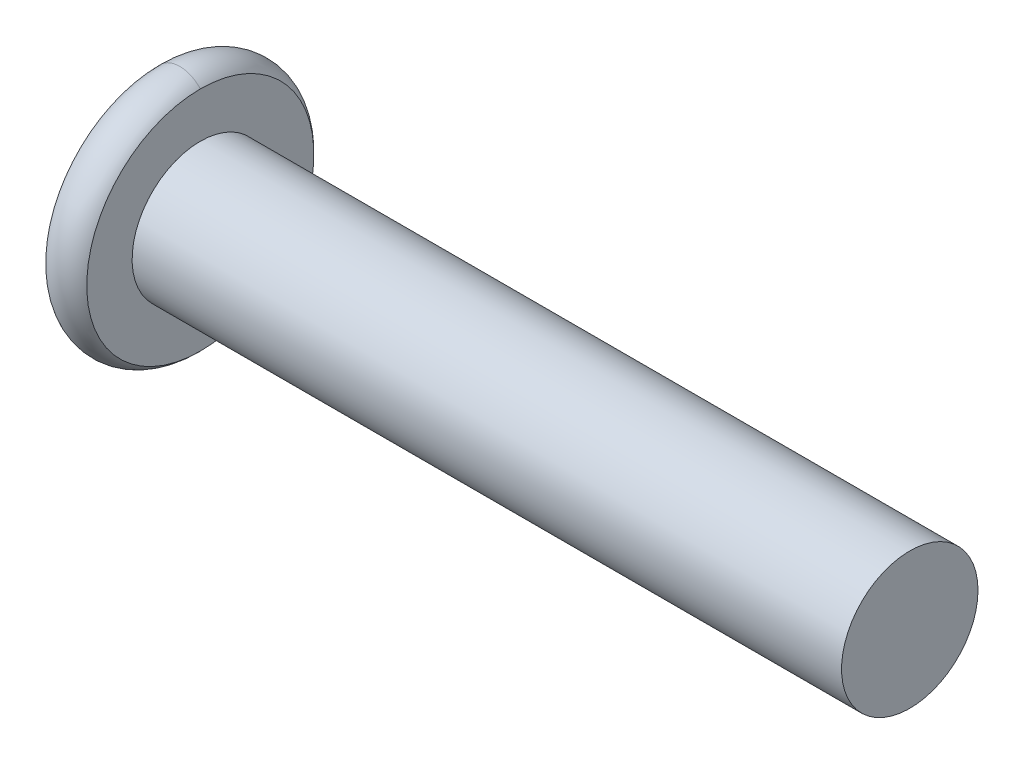
ISO-10303-21;
HEADER;
FILE_DESCRIPTION(('STEP AP214'),'2;1');
FILE_NAME('part.step','',(''),(''),'','','');
FILE_SCHEMA(('AUTOMOTIVE_DESIGN { 1 0 10303 214 1 1 1 1 }'));
ENDSEC;
DATA;
#1=APPLICATION_CONTEXT('core data for automotive mechanical design processes');
#2=APPLICATION_PROTOCOL_DEFINITION('international standard','automotive_design',2000,#1);
#3=PRODUCT_CONTEXT('',#1,'mechanical');
#4=PRODUCT('Part','Part','',(#3));
#5=PRODUCT_RELATED_PRODUCT_CATEGORY('part','',(#4));
#6=PRODUCT_DEFINITION_FORMATION('','',#4);
#7=PRODUCT_DEFINITION_CONTEXT('part definition',#1,'design');
#8=PRODUCT_DEFINITION('design','',#6,#7);
#9=PRODUCT_DEFINITION_SHAPE('','',#8);
#10=(LENGTH_UNIT() NAMED_UNIT(*) SI_UNIT(.MILLI.,.METRE.));
#11=(NAMED_UNIT(*) PLANE_ANGLE_UNIT() SI_UNIT($,.RADIAN.));
#12=(NAMED_UNIT(*) SI_UNIT($,.STERADIAN.) SOLID_ANGLE_UNIT());
#13=UNCERTAINTY_MEASURE_WITH_UNIT(LENGTH_MEASURE(1.E-05),#10,'distance_accuracy_value','');
#14=(GEOMETRIC_REPRESENTATION_CONTEXT(3) GLOBAL_UNCERTAINTY_ASSIGNED_CONTEXT((#13)) GLOBAL_UNIT_ASSIGNED_CONTEXT((#10,
#11,#12)) REPRESENTATION_CONTEXT('',''));
#15=CARTESIAN_POINT('',(0.,0.,0.));
#16=DIRECTION('',(0.,0.,1.));
#17=DIRECTION('',(1.,0.,0.));
#18=AXIS2_PLACEMENT_3D('',#15,#16,#17);
#19=CARTESIAN_POINT('',(-7.2,0.866025403784466,1.5));
#20=DIRECTION('',(0.,0.866025403784439,0.5));
#21=DIRECTION('',(1.,0.,0.));
#22=AXIS2_PLACEMENT_3D('',#19,#20,#21);
#23=PLANE('',#22);
#24=DIRECTION('',(0.,0.5,-0.866025403784439));
#25=VECTOR('',#24,1.);
#26=CARTESIAN_POINT('',(-8.,0.866025403784468,1.5));
#27=LINE('',#26,#25);
#28=CARTESIAN_POINT('',(-8.,0.866025403784469,1.5));
#29=VERTEX_POINT('',#28);
#30=CARTESIAN_POINT('',(-8.,1.73205080756891,0.));
#31=VERTEX_POINT('',#30);
#32=EDGE_CURVE('E61',#29,#31,#27,.T.);
#33=ORIENTED_EDGE('',*,*,#32,.F.);
#34=DIRECTION('',(-1.,0.,0.));
#35=VECTOR('',#34,1.);
#36=CARTESIAN_POINT('',(-7.2,0.866025403784466,1.5));
#37=LINE('',#36,#35);
#38=CARTESIAN_POINT('',(-9.45,0.866025403784475,1.5));
#39=VERTEX_POINT('',#38);
#40=EDGE_CURVE('E11',#29,#39,#37,.T.);
#41=ORIENTED_EDGE('',*,*,#40,.T.);
#42=CARTESIAN_POINT('',(-9.45,0.866025403784475,1.5));
#43=CARTESIAN_POINT('',(-9.21896355129934,1.09706185248514,1.09983313245017));
#44=CARTESIAN_POINT('',(-9.21795258499127,1.29744298091271,0.752762837135629));
#45=CARTESIAN_POINT('',(-9.21693575385997,1.49898656142989,0.403679115740523));
#46=CARTESIAN_POINT('',(-9.45000000000001,1.73205080756891,0.));
#47=B_SPLINE_CURVE_WITH_KNOTS('',2,(#42,#43,#44,#45,#46),.UNSPECIFIED.,.F.,.F.,(3,2,3),(0.,0.5,
1.),.UNSPECIFIED.);
#48=CARTESIAN_POINT('',(-9.45,1.73205080756891,0.));
#49=VERTEX_POINT('',#48);
#50=EDGE_CURVE('E193',#39,#49,#47,.T.);
#51=ORIENTED_EDGE('',*,*,#50,.T.);
#52=DIRECTION('',(-1.,0.,0.));
#53=VECTOR('',#52,1.);
#54=CARTESIAN_POINT('',(-7.2,1.7320508075689,0.));
#55=LINE('',#54,#53);
#56=EDGE_CURVE('E141',#31,#49,#55,.T.);
#57=ORIENTED_EDGE('',*,*,#56,.F.);
#58=EDGE_LOOP('',(#33,#41,#51,#57));
#59=FACE_BOUND('',#58,.T.);
#60=ADVANCED_FACE('F46',(#59),#23,.F.);
#61=CARTESIAN_POINT('',(-7.2,-0.866025403784412,1.5));
#62=DIRECTION('',(0.,0.,1.));
#63=DIRECTION('',(1.,0.,0.));
#64=AXIS2_PLACEMENT_3D('',#61,#62,#63);
#65=PLANE('',#64);
#66=DIRECTION('',(0.,1.,0.));
#67=VECTOR('',#66,1.);
#68=CARTESIAN_POINT('',(-8.,-0.866025403784412,1.5));
#69=LINE('',#68,#67);
#70=CARTESIAN_POINT('',(-8.,-0.866025403784409,1.5));
#71=VERTEX_POINT('',#70);
#72=EDGE_CURVE('E68',#71,#29,#69,.T.);
#73=ORIENTED_EDGE('',*,*,#72,.F.);
#74=DIRECTION('',(-1.,0.,0.));
#75=VECTOR('',#74,1.);
#76=CARTESIAN_POINT('',(-7.2,-0.866025403784412,1.5));
#77=LINE('',#76,#75);
#78=CARTESIAN_POINT('',(-9.45,-0.866025403784403,1.5));
#79=VERTEX_POINT('',#78);
#80=EDGE_CURVE('E55',#71,#79,#77,.T.);
#81=ORIENTED_EDGE('',*,*,#80,.T.);
#82=CARTESIAN_POINT('',(-9.45,-0.866025403784404,1.5));
#83=CARTESIAN_POINT('',(-9.33975644233454,-0.645538288453465,1.5));
#84=CARTESIAN_POINT('',(-9.28279119856986,-0.445791996536774,1.5));
#85=CARTESIAN_POINT('',(-9.21800737472854,-0.218630174111427,1.5));
#86=CARTESIAN_POINT('',(-9.2179492007936,0.000158389989295951,1.5));
#87=CARTESIAN_POINT('',(-9.21789132396221,0.21782956601381,1.5));
#88=CARTESIAN_POINT('',(-9.28285189688767,0.446005016133118,1.5));
#89=CARTESIAN_POINT('',(-9.33952821229706,0.645081828378593,1.5));
#90=CARTESIAN_POINT('',(-9.45,0.866025403784473,1.5));
#91=B_SPLINE_CURVE_WITH_KNOTS('',2,(#82,#83,#84,#85,#86,#87,#88,#89,#90),.UNSPECIFIED.,.F.,.F.,
(3,2,2,2,3),(0.,0.25,0.5,0.75,1.),.UNSPECIFIED.);
#92=EDGE_CURVE('E278',#79,#39,#91,.T.);
#93=ORIENTED_EDGE('',*,*,#92,.T.);
#94=ORIENTED_EDGE('',*,*,#40,.F.);
#95=EDGE_LOOP('',(#73,#81,#93,#94));
#96=FACE_BOUND('',#95,.T.);
#97=ADVANCED_FACE('F222',(#96),#65,.F.);
#98=CARTESIAN_POINT('',(-7.2,-1.73205080756885,0.));
#99=DIRECTION('',(0.,-0.866025403784439,0.5));
#100=DIRECTION('',(-1.,0.,0.));
#101=AXIS2_PLACEMENT_3D('',#98,#99,#100);
#102=PLANE('',#101);
#103=DIRECTION('',(0.,0.5,0.866025403784439));
#104=VECTOR('',#103,1.);
#105=CARTESIAN_POINT('',(-8.,-1.73205080756885,0.));
#106=LINE('',#105,#104);
#107=CARTESIAN_POINT('',(-8.,-1.73205080756885,0.));
#108=VERTEX_POINT('',#107);
#109=EDGE_CURVE('E158',#108,#71,#106,.T.);
#110=ORIENTED_EDGE('',*,*,#109,.F.);
#111=DIRECTION('',(-1.,0.,0.));
#112=VECTOR('',#111,1.);
#113=CARTESIAN_POINT('',(-7.2,-1.73205080756885,0.));
#114=LINE('',#113,#112);
#115=CARTESIAN_POINT('',(-9.45,-1.73205080756884,0.));
#116=VERTEX_POINT('',#115);
#117=EDGE_CURVE('E557',#108,#116,#114,.T.);
#118=ORIENTED_EDGE('',*,*,#117,.T.);
#119=CARTESIAN_POINT('',(-9.45,-1.73205080756884,0.));
#120=CARTESIAN_POINT('',(-9.21896355129749,-1.50101435886632,0.400166867553041));
#121=CARTESIAN_POINT('',(-9.21795258499127,-1.30063323044061,0.747237162864371));
#122=CARTESIAN_POINT('',(-9.21693575386182,-1.09908964992158,1.09632088426268));
#123=CARTESIAN_POINT('',(-9.45,-0.866025403784404,1.5));
#124=B_SPLINE_CURVE_WITH_KNOTS('',2,(#119,#120,#121,#122,#123),.UNSPECIFIED.,.F.,.F.,(3,2,3),
(0.,0.5,1.),.UNSPECIFIED.);
#125=EDGE_CURVE('E204',#116,#79,#124,.T.);
#126=ORIENTED_EDGE('',*,*,#125,.T.);
#127=ORIENTED_EDGE('',*,*,#80,.F.);
#128=EDGE_LOOP('',(#110,#118,#126,#127));
#129=FACE_BOUND('',#128,.T.);
#130=ADVANCED_FACE('F211',(#129),#102,.F.);
#131=CARTESIAN_POINT('',(-7.2,-0.866025403784411,-1.5));
#132=DIRECTION('',(0.,-0.866025403784439,-0.5));
#133=DIRECTION('',(0.,0.5,-0.866025403784439));
#134=AXIS2_PLACEMENT_3D('',#131,#132,#133);
#135=PLANE('',#134);
#136=DIRECTION('',(0.,-0.5,0.866025403784439));
#137=VECTOR('',#136,1.);
#138=CARTESIAN_POINT('',(-8.,-0.866025403784409,-1.5));
#139=LINE('',#138,#137);
#140=CARTESIAN_POINT('',(-8.,-0.866025403784408,-1.5));
#141=VERTEX_POINT('',#140);
#142=EDGE_CURVE('E149',#141,#108,#139,.T.);
#143=ORIENTED_EDGE('',*,*,#142,.F.);
#144=DIRECTION('',(-1.,0.,0.));
#145=VECTOR('',#144,1.);
#146=CARTESIAN_POINT('',(-7.2,-0.866025403784411,-1.5));
#147=LINE('',#146,#145);
#148=CARTESIAN_POINT('',(-9.45,-0.866025403784402,-1.5));
#149=VERTEX_POINT('',#148);
#150=EDGE_CURVE('E140',#141,#149,#147,.T.);
#151=ORIENTED_EDGE('',*,*,#150,.T.);
#152=CARTESIAN_POINT('',(-9.45,-0.866025403784402,-1.5));
#153=CARTESIAN_POINT('',(-9.21896355129935,-1.09706185248507,-1.09983313245016));
#154=CARTESIAN_POINT('',(-9.21795258499128,-1.29744298091264,-0.752762837135629));
#155=CARTESIAN_POINT('',(-9.21693575385997,-1.49898656142982,-0.403679115740524));
#156=CARTESIAN_POINT('',(-9.45,-1.73205080756884,0.));
#157=B_SPLINE_CURVE_WITH_KNOTS('',2,(#152,#153,#154,#155,#156),.UNSPECIFIED.,.F.,.F.,(3,2,3),
(0.,0.5,1.),.UNSPECIFIED.);
#158=EDGE_CURVE('E349',#149,#116,#157,.T.);
#159=ORIENTED_EDGE('',*,*,#158,.T.);
#160=ORIENTED_EDGE('',*,*,#117,.F.);
#161=EDGE_LOOP('',(#143,#151,#159,#160));
#162=FACE_BOUND('',#161,.T.);
#163=ADVANCED_FACE('F221',(#162),#135,.F.);
#164=CARTESIAN_POINT('',(-7.2,0.866025403784466,-1.5));
#165=DIRECTION('',(0.,0.,-1.));
#166=DIRECTION('',(0.,-1.,0.));
#167=AXIS2_PLACEMENT_3D('',#164,#165,#166);
#168=PLANE('',#167);
#169=DIRECTION('',(0.,-1.,0.));
#170=VECTOR('',#169,1.);
#171=CARTESIAN_POINT('',(-8.,0.866025403784466,-1.5));
#172=LINE('',#171,#170);
#173=CARTESIAN_POINT('',(-8.,0.866025403784469,-1.5));
#174=VERTEX_POINT('',#173);
#175=EDGE_CURVE('E145',#174,#141,#172,.T.);
#176=ORIENTED_EDGE('',*,*,#175,.F.);
#177=DIRECTION('',(-1.,0.,0.));
#178=VECTOR('',#177,1.);
#179=CARTESIAN_POINT('',(-7.2,0.866025403784466,-1.5));
#180=LINE('',#179,#178);
#181=CARTESIAN_POINT('',(-9.45,0.866025403784475,-1.5));
#182=VERTEX_POINT('',#181);
#183=EDGE_CURVE('E129',#174,#182,#180,.T.);
#184=ORIENTED_EDGE('',*,*,#183,.T.);
#185=CARTESIAN_POINT('',(-9.45,0.866025403784475,-1.5));
#186=CARTESIAN_POINT('',(-9.33981414699266,0.645653697769757,-1.5));
#187=CARTESIAN_POINT('',(-9.28285189688768,0.446005016133116,-1.5));
#188=CARTESIAN_POINT('',(-9.2180530845752,0.21888973494314,-1.5));
#189=CARTESIAN_POINT('',(-9.2179492007936,0.000158389989295951,-1.5));
#190=CARTESIAN_POINT('',(-9.21784579402437,-0.217568586838098,-1.5));
#191=CARTESIAN_POINT('',(-9.28279119856986,-0.445791996536774,-1.5));
#192=CARTESIAN_POINT('',(-9.33946967648958,-0.644964756763549,-1.5));
#193=CARTESIAN_POINT('',(-9.45,-0.866025403784404,-1.5));
#194=B_SPLINE_CURVE_WITH_KNOTS('',2,(#185,#186,#187,#188,#189,#190,#191,#192,#193),
.UNSPECIFIED.,.F.,.F.,(3,2,2,2,3),(0.,0.25,0.5,0.75,1.),.UNSPECIFIED.);
#195=EDGE_CURVE('E199',#182,#149,#194,.T.);
#196=ORIENTED_EDGE('',*,*,#195,.T.);
#197=ORIENTED_EDGE('',*,*,#150,.F.);
#198=EDGE_LOOP('',(#176,#184,#196,#197));
#199=FACE_BOUND('',#198,.T.);
#200=ADVANCED_FACE('F146',(#199),#168,.F.);
#201=CARTESIAN_POINT('',(-7.2,1.7320508075689,0.));
#202=DIRECTION('',(0.,0.866025403784439,-0.5));
#203=DIRECTION('',(-1.,0.,0.));
#204=AXIS2_PLACEMENT_3D('',#201,#202,#203);
#205=PLANE('',#204);
#206=DIRECTION('',(0.,-0.5,-0.866025403784439));
#207=VECTOR('',#206,1.);
#208=CARTESIAN_POINT('',(-8.,1.73205080756891,0.));
#209=LINE('',#208,#207);
#210=EDGE_CURVE('E133',#31,#174,#209,.T.);
#211=ORIENTED_EDGE('',*,*,#210,.F.);
#212=ORIENTED_EDGE('',*,*,#56,.T.);
#213=CARTESIAN_POINT('',(-9.45,1.73205080756891,0.));
#214=CARTESIAN_POINT('',(-9.21896355129874,1.50101435886761,-0.400166867550929));
#215=CARTESIAN_POINT('',(-9.21795258499128,1.30063323044068,-0.747237162864371));
#216=CARTESIAN_POINT('',(-9.21693575386058,1.09908964992289,-1.09632088426053));
#217=CARTESIAN_POINT('',(-9.45000000000001,0.866025403784475,-1.5));
#218=B_SPLINE_CURVE_WITH_KNOTS('',2,(#213,#214,#215,#216,#217),.UNSPECIFIED.,.F.,.F.,(3,2,3),
(0.,0.5,1.),.UNSPECIFIED.);
#219=EDGE_CURVE('E135',#49,#182,#218,.T.);
#220=ORIENTED_EDGE('',*,*,#219,.T.);
#221=ORIENTED_EDGE('',*,*,#183,.F.);
#222=EDGE_LOOP('',(#211,#212,#220,#221));
#223=FACE_BOUND('',#222,.T.);
#224=ADVANCED_FACE('F131',(#223),#205,.F.);
#225=CARTESIAN_POINT('',(-9.5,0.,0.));
#226=DIRECTION('',(-1.,0.,0.));
#227=DIRECTION('',(0.,-1.,0.));
#228=AXIS2_PLACEMENT_3D('',#225,#226,#227);
#229=CONICAL_SURFACE('',#228,1.78205080756887,0.78539816339745);
#230=DIRECTION('',(-0.707106781186544,0.707106781186552,0.));
#231=VECTOR('',#230,1.);
#232=CARTESIAN_POINT('',(-9.5,1.7820508075689,0.));
#233=LINE('',#232,#231);
#234=CARTESIAN_POINT('',(-9.5,1.7820508075689,0.));
#235=VERTEX_POINT('',#234);
#236=EDGE_CURVE('E174',#49,#235,#233,.T.);
#237=ORIENTED_EDGE('',*,*,#236,.F.);
#238=ORIENTED_EDGE('',*,*,#50,.F.);
#239=ORIENTED_EDGE('',*,*,#92,.F.);
#240=ORIENTED_EDGE('',*,*,#125,.F.);
#241=DIRECTION('',(-0.707106781186549,-0.707106781186546,0.));
#242=VECTOR('',#241,1.);
#243=CARTESIAN_POINT('',(-9.5,-1.78205080756883,0.));
#244=LINE('',#243,#242);
#245=CARTESIAN_POINT('',(-9.5,-1.78205080756883,0.));
#246=VERTEX_POINT('',#245);
#247=EDGE_CURVE('E173',#116,#246,#244,.T.);
#248=ORIENTED_EDGE('',*,*,#247,.T.);
#249=CARTESIAN_POINT('',(-9.5,0.,0.));
#250=DIRECTION('',(-1.,0.,0.));
#251=DIRECTION('',(0.,-1.,0.));
#252=AXIS2_PLACEMENT_3D('',#249,#250,#251);
#253=CIRCLE('',#252,1.78205080756887);
#254=EDGE_CURVE('E187',#246,#235,#253,.T.);
#255=ORIENTED_EDGE('',*,*,#254,.T.);
#256=EDGE_LOOP('',(#237,#238,#239,#240,#248,#255));
#257=FACE_BOUND('',#256,.T.);
#258=ADVANCED_FACE('F250',(#257),#229,.F.);
#259=CARTESIAN_POINT('',(-8.,4.16143782776614,0.));
#260=DIRECTION('',(1.,0.,0.));
#261=DIRECTION('',(0.,1.,0.));
#262=AXIS2_PLACEMENT_3D('',#259,#260,#261);
#263=PLANE('',#262);
#264=CARTESIAN_POINT('',(-8.,0.,0.));
#265=DIRECTION('',(-1.,0.,0.));
#266=DIRECTION('',(0.,1.,0.));
#267=AXIS2_PLACEMENT_3D('',#264,#265,#266);
#268=CIRCLE('',#267,2.5);
#269=CARTESIAN_POINT('',(-8.,2.49999999999999,0.));
#270=VERTEX_POINT('',#269);
#271=EDGE_CURVE('E179',#270,#270,#268,.T.);
#272=ORIENTED_EDGE('',*,*,#271,.T.);
#273=EDGE_LOOP('',(#272));
#274=FACE_BOUND('',#273,.T.);
#275=CARTESIAN_POINT('',(-8.,0.,0.));
#276=DIRECTION('',(1.,0.,0.));
#277=DIRECTION('',(0.,1.,0.));
#278=AXIS2_PLACEMENT_3D('',#275,#276,#277);
#279=CIRCLE('',#278,4.16143782776614);
#280=CARTESIAN_POINT('',(-8.,4.16143782776614,0.));
#281=VERTEX_POINT('',#280);
#282=CARTESIAN_POINT('',(-8.,-4.16143782776614,0.));
#283=VERTEX_POINT('',#282);
#284=EDGE_CURVE('E167',#281,#283,#279,.T.);
#285=ORIENTED_EDGE('',*,*,#284,.T.);
#286=CARTESIAN_POINT('',(-8.,0.,0.));
#287=DIRECTION('',(1.,0.,0.));
#288=DIRECTION('',(0.,1.,0.));
#289=AXIS2_PLACEMENT_3D('',#286,#287,#288);
#290=CIRCLE('',#289,4.16143782776614);
#291=EDGE_CURVE('E190',#283,#281,#290,.T.);
#292=ORIENTED_EDGE('',*,*,#291,.T.);
#293=EDGE_LOOP('',(#285,#292));
#294=FACE_BOUND('',#293,.T.);
#295=ADVANCED_FACE('F48',(#274,#294),#263,.T.);
#296=CARTESIAN_POINT('',(-8.75,0.,0.));
#297=DIRECTION('',(1.,0.,0.));
#298=DIRECTION('',(0.,1.,0.));
#299=AXIS2_PLACEMENT_3D('',#296,#297,#298);
#300=TOROIDAL_SURFACE('',#299,3.5,1.);
#301=CARTESIAN_POINT('',(-8.75,-3.5,0.));
#302=DIRECTION('',(0.,0.,1.));
#303=DIRECTION('',(0.,-1.,0.));
#304=AXIS2_PLACEMENT_3D('',#301,#302,#303);
#305=CIRCLE('',#304,1.);
#306=CARTESIAN_POINT('',(-9.5,-4.16143782776615,0.));
#307=VERTEX_POINT('',#306);
#308=EDGE_CURVE('E163',#307,#283,#305,.T.);
#309=ORIENTED_EDGE('',*,*,#308,.F.);
#310=CARTESIAN_POINT('',(-9.5,0.,0.));
#311=DIRECTION('',(1.,0.,0.));
#312=DIRECTION('',(0.,1.,0.));
#313=AXIS2_PLACEMENT_3D('',#310,#311,#312);
#314=CIRCLE('',#313,4.16143782776615);
#315=CARTESIAN_POINT('',(-9.5,4.16143782776614,0.));
#316=VERTEX_POINT('',#315);
#317=EDGE_CURVE('E183',#307,#316,#314,.T.);
#318=ORIENTED_EDGE('',*,*,#317,.T.);
#319=CARTESIAN_POINT('',(-8.75,3.5,0.));
#320=DIRECTION('',(0.,0.,-1.));
#321=DIRECTION('',(-1.,0.,0.));
#322=AXIS2_PLACEMENT_3D('',#319,#320,#321);
#323=CIRCLE('',#322,1.);
#324=EDGE_CURVE('E178',#316,#281,#323,.T.);
#325=ORIENTED_EDGE('',*,*,#324,.T.);
#326=ORIENTED_EDGE('',*,*,#291,.F.);
#327=EDGE_LOOP('',(#309,#318,#325,#326));
#328=FACE_BOUND('',#327,.T.);
#329=ADVANCED_FACE('F292',(#328),#300,.T.);
#330=CARTESIAN_POINT('',(-9.5,0.,0.));
#331=DIRECTION('',(-1.,0.,0.));
#332=DIRECTION('',(0.,1.,0.));
#333=AXIS2_PLACEMENT_3D('',#330,#331,#332);
#334=PLANE('',#333);
#335=ORIENTED_EDGE('',*,*,#254,.F.);
#336=CARTESIAN_POINT('',(-9.5,0.,0.));
#337=DIRECTION('',(-1.,0.,0.));
#338=DIRECTION('',(0.,-1.,0.));
#339=AXIS2_PLACEMENT_3D('',#336,#337,#338);
#340=CIRCLE('',#339,1.78205080756887);
#341=EDGE_CURVE('E169',#235,#246,#340,.T.);
#342=ORIENTED_EDGE('',*,*,#341,.F.);
#343=EDGE_LOOP('',(#335,#342));
#344=FACE_BOUND('',#343,.T.);
#345=CARTESIAN_POINT('',(-9.5,0.,0.));
#346=DIRECTION('',(1.,0.,0.));
#347=DIRECTION('',(0.,1.,0.));
#348=AXIS2_PLACEMENT_3D('',#345,#346,#347);
#349=CIRCLE('',#348,4.16143782776615);
#350=EDGE_CURVE('E168',#316,#307,#349,.T.);
#351=ORIENTED_EDGE('',*,*,#350,.F.);
#352=ORIENTED_EDGE('',*,*,#317,.F.);
#353=EDGE_LOOP('',(#351,#352));
#354=FACE_BOUND('',#353,.T.);
#355=ADVANCED_FACE('F290',(#344,#354),#334,.T.);
#356=CARTESIAN_POINT('',(-8.,0.,0.));
#357=DIRECTION('',(1.,0.,0.));
#358=DIRECTION('',(0.,0.,-1.));
#359=AXIS2_PLACEMENT_3D('',#356,#357,#358);
#360=CYLINDRICAL_SURFACE('',#359,2.5);
#361=ORIENTED_EDGE('',*,*,#271,.F.);
#362=EDGE_LOOP('',(#361));
#363=FACE_BOUND('',#362,.T.);
#364=CARTESIAN_POINT('',(18.,0.,0.));
#365=DIRECTION('',(1.,0.,0.));
#366=DIRECTION('',(0.,0.,-1.));
#367=AXIS2_PLACEMENT_3D('',#364,#365,#366);
#368=CIRCLE('',#367,2.5);
#369=CARTESIAN_POINT('',(18.,0.,-2.5));
#370=VERTEX_POINT('',#369);
#371=EDGE_CURVE('E152',#370,#370,#368,.T.);
#372=ORIENTED_EDGE('',*,*,#371,.F.);
#373=EDGE_LOOP('',(#372));
#374=FACE_BOUND('',#373,.T.);
#375=ADVANCED_FACE('F228',(#363,#374),#360,.T.);
#376=CARTESIAN_POINT('',(-8.75,0.,0.));
#377=DIRECTION('',(1.,0.,0.));
#378=DIRECTION('',(0.,1.,0.));
#379=AXIS2_PLACEMENT_3D('',#376,#377,#378);
#380=TOROIDAL_SURFACE('',#379,3.5,1.);
#381=ORIENTED_EDGE('',*,*,#350,.T.);
#382=ORIENTED_EDGE('',*,*,#308,.T.);
#383=ORIENTED_EDGE('',*,*,#284,.F.);
#384=ORIENTED_EDGE('',*,*,#324,.F.);
#385=EDGE_LOOP('',(#381,#382,#383,#384));
#386=FACE_BOUND('',#385,.T.);
#387=ADVANCED_FACE('F298',(#386),#380,.T.);
#388=CARTESIAN_POINT('',(-9.5,0.,0.));
#389=DIRECTION('',(-1.,0.,0.));
#390=DIRECTION('',(0.,-1.,0.));
#391=AXIS2_PLACEMENT_3D('',#388,#389,#390);
#392=CONICAL_SURFACE('',#391,1.78205080756887,0.78539816339745);
#393=ORIENTED_EDGE('',*,*,#219,.F.);
#394=ORIENTED_EDGE('',*,*,#236,.T.);
#395=ORIENTED_EDGE('',*,*,#341,.T.);
#396=ORIENTED_EDGE('',*,*,#247,.F.);
#397=ORIENTED_EDGE('',*,*,#158,.F.);
#398=ORIENTED_EDGE('',*,*,#195,.F.);
#399=EDGE_LOOP('',(#393,#394,#395,#396,#397,#398));
#400=FACE_BOUND('',#399,.T.);
#401=ADVANCED_FACE('F325',(#400),#392,.F.);
#402=CARTESIAN_POINT('',(-8.,0.,0.));
#403=DIRECTION('',(1.,0.,0.));
#404=DIRECTION('',(0.,0.,-1.));
#405=AXIS2_PLACEMENT_3D('',#402,#403,#404);
#406=PLANE('',#405);
#407=ORIENTED_EDGE('',*,*,#72,.T.);
#408=ORIENTED_EDGE('',*,*,#32,.T.);
#409=ORIENTED_EDGE('',*,*,#210,.T.);
#410=ORIENTED_EDGE('',*,*,#175,.T.);
#411=ORIENTED_EDGE('',*,*,#142,.T.);
#412=ORIENTED_EDGE('',*,*,#109,.T.);
#413=EDGE_LOOP('',(#407,#408,#409,#410,#411,#412));
#414=FACE_BOUND('',#413,.T.);
#415=ADVANCED_FACE('F151',(#414),#406,.F.);
#416=CARTESIAN_POINT('',(18.,0.,0.));
#417=DIRECTION('',(1.,0.,0.));
#418=DIRECTION('',(0.,0.,-1.));
#419=AXIS2_PLACEMENT_3D('',#416,#417,#418);
#420=PLANE('',#419);
#421=ORIENTED_EDGE('',*,*,#371,.T.);
#422=EDGE_LOOP('',(#421));
#423=FACE_BOUND('',#422,.T.);
#424=ADVANCED_FACE('F319',(#423),#420,.T.);
#425=CLOSED_SHELL('',(#60,#97,#130,#163,#200,#224,#258,#295,#329,#355,#375,#387,#401,#415,#424));
#426=MANIFOLD_SOLID_BREP('B2',#425);
#427=ADVANCED_BREP_SHAPE_REPRESENTATION('',(#18,#426),#14);
#428=SHAPE_DEFINITION_REPRESENTATION(#9,#427);
ENDSEC;
END-ISO-10303-21;
